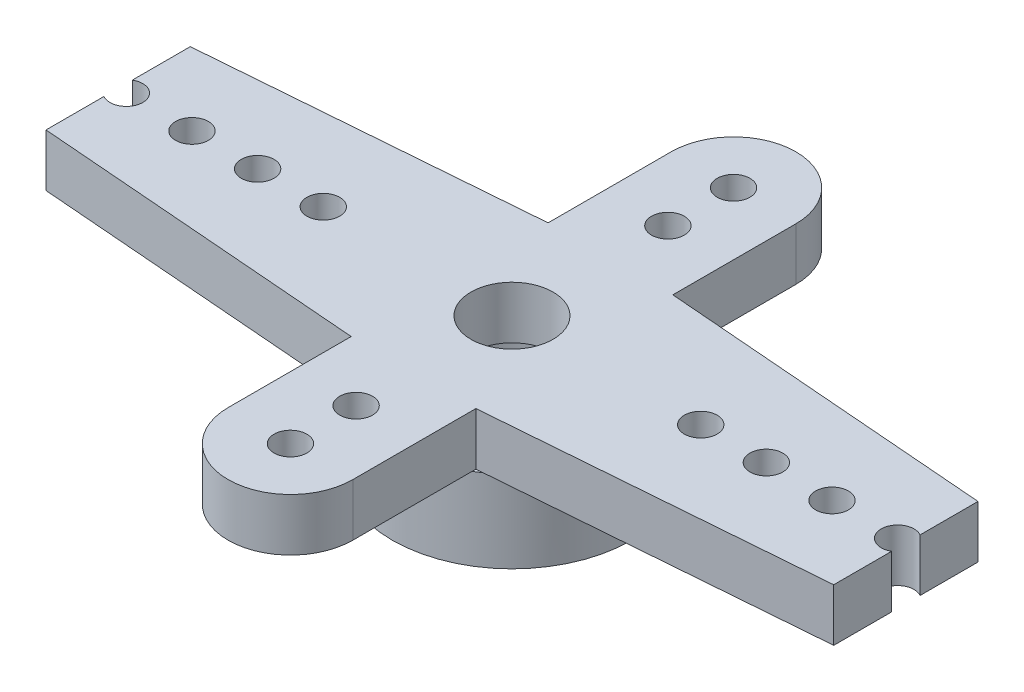
ISO-10303-21;
HEADER;
FILE_DESCRIPTION(('STEP AP214'),'2;1');
FILE_NAME('part.step','',(''),(''),'','','');
FILE_SCHEMA(('AUTOMOTIVE_DESIGN { 1 0 10303 214 1 1 1 1 }'));
ENDSEC;
DATA;
#1=APPLICATION_CONTEXT('core data for automotive mechanical design processes');
#2=APPLICATION_PROTOCOL_DEFINITION('international standard','automotive_design',2000,#1);
#3=PRODUCT_CONTEXT('',#1,'mechanical');
#4=PRODUCT('Part','Part','',(#3));
#5=PRODUCT_RELATED_PRODUCT_CATEGORY('part','',(#4));
#6=PRODUCT_DEFINITION_FORMATION('','',#4);
#7=PRODUCT_DEFINITION_CONTEXT('part definition',#1,'design');
#8=PRODUCT_DEFINITION('design','',#6,#7);
#9=PRODUCT_DEFINITION_SHAPE('','',#8);
#10=(LENGTH_UNIT() NAMED_UNIT(*) SI_UNIT(.MILLI.,.METRE.));
#11=(NAMED_UNIT(*) PLANE_ANGLE_UNIT() SI_UNIT($,.RADIAN.));
#12=(NAMED_UNIT(*) SI_UNIT($,.STERADIAN.) SOLID_ANGLE_UNIT());
#13=UNCERTAINTY_MEASURE_WITH_UNIT(LENGTH_MEASURE(1.E-05),#10,'distance_accuracy_value','');
#14=(GEOMETRIC_REPRESENTATION_CONTEXT(3) GLOBAL_UNCERTAINTY_ASSIGNED_CONTEXT((#13)) GLOBAL_UNIT_ASSIGNED_CONTEXT((#10,
#11,#12)) REPRESENTATION_CONTEXT('',''));
#15=CARTESIAN_POINT('',(0.,0.,0.));
#16=DIRECTION('',(0.,0.,1.));
#17=DIRECTION('',(1.,0.,0.));
#18=AXIS2_PLACEMENT_3D('',#15,#16,#17);
#19=CARTESIAN_POINT('',(0.,2.5,0.));
#20=DIRECTION('',(0.,1.,0.));
#21=DIRECTION('',(0.,0.,1.));
#22=AXIS2_PLACEMENT_3D('',#19,#20,#21);
#23=PLANE('',#22);
#24=DIRECTION('',(0.,0.,-1.));
#25=VECTOR('',#24,1.);
#26=CARTESIAN_POINT('',(1.9,2.5,-6.75));
#27=LINE('',#26,#25);
#28=CARTESIAN_POINT('',(1.9,2.5,-3.));
#29=VERTEX_POINT('',#28);
#30=CARTESIAN_POINT('',(1.9,2.5,-3.11648840844948));
#31=VERTEX_POINT('',#30);
#32=EDGE_CURVE('E244',#29,#31,#27,.T.);
#33=ORIENTED_EDGE('',*,*,#32,.F.);
#34=DIRECTION('',(-0.996860885732547,0.,-0.0791730667368807));
#35=VECTOR('',#34,1.);
#36=CARTESIAN_POINT('',(15.75,2.5,-1.9));
#37=LINE('',#36,#35);
#38=CARTESIAN_POINT('',(2.10202641784576,2.5,-2.9839545805321));
#39=VERTEX_POINT('',#38);
#40=EDGE_CURVE('E243',#39,#29,#37,.T.);
#41=ORIENTED_EDGE('',*,*,#40,.F.);
#42=CARTESIAN_POINT('',(0.,2.5,0.));
#43=DIRECTION('',(0.,1.,0.));
#44=DIRECTION('',(0.,0.,1.));
#45=AXIS2_PLACEMENT_3D('',#42,#43,#44);
#46=CIRCLE('',#45,3.65);
#47=EDGE_CURVE('E475',#39,#31,#46,.T.);
#48=ORIENTED_EDGE('',*,*,#47,.T.);
#49=EDGE_LOOP('',(#33,#41,#48));
#50=FACE_BOUND('',#49,.T.);
#51=ADVANCED_FACE('F36',(#50),#23,.T.);
#52=DIRECTION('',(0.996860885732547,0.,-0.0791730667368813));
#53=VECTOR('',#52,1.);
#54=CARTESIAN_POINT('',(15.75,2.5,1.9));
#55=LINE('',#54,#53);
#56=CARTESIAN_POINT('',(1.9,2.5,3.00000000000001));
#57=VERTEX_POINT('',#56);
#58=CARTESIAN_POINT('',(2.10202641784575,2.5,2.98395458053211));
#59=VERTEX_POINT('',#58);
#60=EDGE_CURVE('E237',#57,#59,#55,.T.);
#61=ORIENTED_EDGE('',*,*,#60,.F.);
#62=DIRECTION('',(0.,0.,-1.));
#63=VECTOR('',#62,1.);
#64=CARTESIAN_POINT('',(1.9,2.5,6.75000000000001));
#65=LINE('',#64,#63);
#66=CARTESIAN_POINT('',(1.9,2.5,3.11648840844948));
#67=VERTEX_POINT('',#66);
#68=EDGE_CURVE('E236',#67,#57,#65,.T.);
#69=ORIENTED_EDGE('',*,*,#68,.F.);
#70=EDGE_CURVE('E276',#67,#59,#46,.T.);
#71=ORIENTED_EDGE('',*,*,#70,.T.);
#72=EDGE_LOOP('',(#61,#69,#71));
#73=FACE_BOUND('',#72,.T.);
#74=ADVANCED_FACE('F430',(#73),#23,.T.);
#75=DIRECTION('',(0.,0.,1.));
#76=VECTOR('',#75,1.);
#77=CARTESIAN_POINT('',(-1.9,2.5,6.75000000000001));
#78=LINE('',#77,#76);
#79=CARTESIAN_POINT('',(-1.9,2.5,3.00000000000001));
#80=VERTEX_POINT('',#79);
#81=CARTESIAN_POINT('',(-1.9,2.5,3.11648840844949));
#82=VERTEX_POINT('',#81);
#83=EDGE_CURVE('E227',#80,#82,#78,.T.);
#84=ORIENTED_EDGE('',*,*,#83,.F.);
#85=DIRECTION('',(0.996860885732547,0.,0.0791730667368811));
#86=VECTOR('',#85,1.);
#87=CARTESIAN_POINT('',(-15.75,2.5,1.9));
#88=LINE('',#87,#86);
#89=CARTESIAN_POINT('',(-2.10202641784575,2.5,2.98395458053211));
#90=VERTEX_POINT('',#89);
#91=EDGE_CURVE('E226',#90,#80,#88,.T.);
#92=ORIENTED_EDGE('',*,*,#91,.F.);
#93=EDGE_CURVE('E478',#90,#82,#46,.T.);
#94=ORIENTED_EDGE('',*,*,#93,.T.);
#95=EDGE_LOOP('',(#84,#92,#94));
#96=FACE_BOUND('',#95,.T.);
#97=ADVANCED_FACE('F437',(#96),#23,.T.);
#98=DIRECTION('',(-0.996860885732547,0.,0.079173066736881));
#99=VECTOR('',#98,1.);
#100=CARTESIAN_POINT('',(-15.75,2.5,-1.9));
#101=LINE('',#100,#99);
#102=CARTESIAN_POINT('',(-1.9,2.5,-3.));
#103=VERTEX_POINT('',#102);
#104=CARTESIAN_POINT('',(-2.10202641784576,2.5,-2.9839545805321));
#105=VERTEX_POINT('',#104);
#106=EDGE_CURVE('E220',#103,#105,#101,.T.);
#107=ORIENTED_EDGE('',*,*,#106,.F.);
#108=DIRECTION('',(0.,0.,1.));
#109=VECTOR('',#108,1.);
#110=CARTESIAN_POINT('',(-1.9,2.5,-6.75));
#111=LINE('',#110,#109);
#112=CARTESIAN_POINT('',(-1.9,2.5,-3.11648840844949));
#113=VERTEX_POINT('',#112);
#114=EDGE_CURVE('E219',#113,#103,#111,.T.);
#115=ORIENTED_EDGE('',*,*,#114,.F.);
#116=EDGE_CURVE('E452',#113,#105,#46,.T.);
#117=ORIENTED_EDGE('',*,*,#116,.T.);
#118=EDGE_LOOP('',(#107,#115,#117));
#119=FACE_BOUND('',#118,.T.);
#120=ADVANCED_FACE('F433',(#119),#23,.T.);
#121=CARTESIAN_POINT('',(0.,0.,0.));
#122=DIRECTION('',(0.,1.,0.));
#123=DIRECTION('',(0.,0.,1.));
#124=AXIS2_PLACEMENT_3D('',#121,#122,#123);
#125=PLANE('',#124);
#126=CARTESIAN_POINT('',(0.,0.,0.));
#127=DIRECTION('',(0.,1.,0.));
#128=DIRECTION('',(0.,0.,1.));
#129=AXIS2_PLACEMENT_3D('',#126,#127,#128);
#130=CIRCLE('',#129,3.65);
#131=CARTESIAN_POINT('',(0.,0.,3.65));
#132=VERTEX_POINT('',#131);
#133=EDGE_CURVE('E275',#132,#132,#130,.T.);
#134=ORIENTED_EDGE('',*,*,#133,.F.);
#135=EDGE_LOOP('',(#134));
#136=FACE_BOUND('',#135,.T.);
#137=CARTESIAN_POINT('',(0.,0.,0.));
#138=DIRECTION('',(0.,1.,0.));
#139=DIRECTION('',(0.,0.,1.));
#140=AXIS2_PLACEMENT_3D('',#137,#138,#139);
#141=CIRCLE('',#140,2.5);
#142=CARTESIAN_POINT('',(0.,0.,2.5));
#143=VERTEX_POINT('',#142);
#144=EDGE_CURVE('E272',#143,#143,#141,.T.);
#145=ORIENTED_EDGE('',*,*,#144,.T.);
#146=EDGE_LOOP('',(#145));
#147=FACE_BOUND('',#146,.T.);
#148=ADVANCED_FACE('F441',(#136,#147),#125,.F.);
#149=CARTESIAN_POINT('',(0.,2.5,0.));
#150=DIRECTION('',(0.,-1.,0.));
#151=DIRECTION('',(0.,0.,-1.));
#152=AXIS2_PLACEMENT_3D('',#149,#150,#151);
#153=CYLINDRICAL_SURFACE('',#152,3.65);
#154=ORIENTED_EDGE('',*,*,#70,.F.);
#155=EDGE_CURVE('E280',#82,#67,#46,.T.);
#156=ORIENTED_EDGE('',*,*,#155,.F.);
#157=ORIENTED_EDGE('',*,*,#93,.F.);
#158=EDGE_CURVE('E476',#105,#90,#46,.T.);
#159=ORIENTED_EDGE('',*,*,#158,.F.);
#160=ORIENTED_EDGE('',*,*,#116,.F.);
#161=EDGE_CURVE('E471',#31,#113,#46,.T.);
#162=ORIENTED_EDGE('',*,*,#161,.F.);
#163=ORIENTED_EDGE('',*,*,#47,.F.);
#164=EDGE_CURVE('E279',#59,#39,#46,.T.);
#165=ORIENTED_EDGE('',*,*,#164,.F.);
#166=EDGE_LOOP('',(#154,#156,#157,#159,#160,#162,#163,#165));
#167=FACE_BOUND('',#166,.T.);
#168=ORIENTED_EDGE('',*,*,#133,.T.);
#169=EDGE_LOOP('',(#168));
#170=FACE_BOUND('',#169,.T.);
#171=ADVANCED_FACE('F38',(#167,#170),#153,.T.);
#172=CARTESIAN_POINT('',(0.,2.5,0.));
#173=DIRECTION('',(0.,-1.,0.));
#174=DIRECTION('',(0.,0.,-1.));
#175=AXIS2_PLACEMENT_3D('',#172,#173,#174);
#176=CYLINDRICAL_SURFACE('',#175,2.5);
#177=CARTESIAN_POINT('',(0.,2.5,0.));
#178=DIRECTION('',(0.,1.,0.));
#179=DIRECTION('',(0.,0.,1.));
#180=AXIS2_PLACEMENT_3D('',#177,#178,#179);
#181=CIRCLE('',#180,2.5);
#182=CARTESIAN_POINT('',(0.,2.5,2.5));
#183=VERTEX_POINT('',#182);
#184=EDGE_CURVE('E269',#183,#183,#181,.T.);
#185=ORIENTED_EDGE('',*,*,#184,.T.);
#186=EDGE_LOOP('',(#185));
#187=FACE_BOUND('',#186,.T.);
#188=ORIENTED_EDGE('',*,*,#144,.F.);
#189=EDGE_LOOP('',(#188));
#190=FACE_BOUND('',#189,.T.);
#191=ADVANCED_FACE('F576',(#187,#190),#176,.F.);
#192=CARTESIAN_POINT('',(0.,2.5,-6.75));
#193=DIRECTION('',(0.,-1.,0.));
#194=DIRECTION('',(0.,0.,-1.));
#195=AXIS2_PLACEMENT_3D('',#192,#193,#194);
#196=PLANE('',#195);
#197=DIRECTION('',(0.,0.,-1.));
#198=VECTOR('',#197,1.);
#199=CARTESIAN_POINT('',(12.,2.5,-6.75000000000008));
#200=LINE('',#199,#198);
#201=CARTESIAN_POINT('',(12.,2.5,2.19783393501805));
#202=VERTEX_POINT('',#201);
#203=CARTESIAN_POINT('',(12.,2.5,0.433012701892139));
#204=VERTEX_POINT('',#203);
#205=EDGE_CURVE('E181',#202,#204,#200,.T.);
#206=ORIENTED_EDGE('',*,*,#205,.F.);
#207=EDGE_CURVE('E235',#59,#202,#55,.T.);
#208=ORIENTED_EDGE('',*,*,#207,.F.);
#209=ORIENTED_EDGE('',*,*,#164,.T.);
#210=CARTESIAN_POINT('',(12.,2.5,-2.19783393501805));
#211=VERTEX_POINT('',#210);
#212=EDGE_CURVE('E240',#211,#39,#37,.T.);
#213=ORIENTED_EDGE('',*,*,#212,.F.);
#214=CARTESIAN_POINT('',(12.,2.5,-0.433012701892303));
#215=VERTEX_POINT('',#214);
#216=EDGE_CURVE('E177',#215,#211,#200,.T.);
#217=ORIENTED_EDGE('',*,*,#216,.F.);
#218=CARTESIAN_POINT('',(11.75,2.5,0.));
#219=DIRECTION('',(0.,-1.,0.));
#220=DIRECTION('',(0.,0.,-1.));
#221=AXIS2_PLACEMENT_3D('',#218,#219,#220);
#222=CIRCLE('',#221,0.500000000000003);
#223=EDGE_CURVE('E364',#215,#204,#222,.F.);
#224=ORIENTED_EDGE('',*,*,#223,.T.);
#225=EDGE_LOOP('',(#206,#208,#209,#213,#217,#224));
#226=FACE_BOUND('',#225,.T.);
#227=CARTESIAN_POINT('',(7.75,2.5,0.));
#228=DIRECTION('',(0.,-1.,0.));
#229=DIRECTION('',(0.,0.,-1.));
#230=AXIS2_PLACEMENT_3D('',#227,#228,#229);
#231=CIRCLE('',#230,0.5);
#232=CARTESIAN_POINT('',(7.75,2.5,-0.500000000000052));
#233=VERTEX_POINT('',#232);
#234=EDGE_CURVE('E376',#233,#233,#231,.F.);
#235=ORIENTED_EDGE('',*,*,#234,.T.);
#236=EDGE_LOOP('',(#235));
#237=FACE_BOUND('',#236,.T.);
#238=CARTESIAN_POINT('',(9.75,2.5,0.));
#239=DIRECTION('',(0.,-1.,0.));
#240=DIRECTION('',(0.,0.,-1.));
#241=AXIS2_PLACEMENT_3D('',#238,#239,#240);
#242=CIRCLE('',#241,0.500000000000003);
#243=CARTESIAN_POINT('',(9.75,2.5,-0.500000000000069));
#244=VERTEX_POINT('',#243);
#245=EDGE_CURVE('E382',#244,#244,#242,.F.);
#246=ORIENTED_EDGE('',*,*,#245,.T.);
#247=EDGE_LOOP('',(#246));
#248=FACE_BOUND('',#247,.T.);
#249=CARTESIAN_POINT('',(5.75,2.5,0.));
#250=DIRECTION('',(0.,-1.,0.));
#251=DIRECTION('',(0.,0.,-1.));
#252=AXIS2_PLACEMENT_3D('',#249,#250,#251);
#253=CIRCLE('',#252,0.5);
#254=CARTESIAN_POINT('',(5.75,2.5,-0.500000000000038));
#255=VERTEX_POINT('',#254);
#256=EDGE_CURVE('E306',#255,#255,#253,.F.);
#257=ORIENTED_EDGE('',*,*,#256,.T.);
#258=EDGE_LOOP('',(#257));
#259=FACE_BOUND('',#258,.T.);
#260=ADVANCED_FACE('F411',(#226,#237,#248,#259),#196,.T.);
#261=CARTESIAN_POINT('',(0.,2.5,-6.75));
#262=DIRECTION('',(0.,-1.,0.));
#263=DIRECTION('',(0.,0.,-1.));
#264=AXIS2_PLACEMENT_3D('',#261,#262,#263);
#265=CIRCLE('',#264,0.5);
#266=CARTESIAN_POINT('',(0.,2.5,-7.25));
#267=VERTEX_POINT('',#266);
#268=EDGE_CURVE('E310',#267,#267,#265,.F.);
#269=ORIENTED_EDGE('',*,*,#268,.T.);
#270=EDGE_LOOP('',(#269));
#271=FACE_BOUND('',#270,.T.);
#272=CARTESIAN_POINT('',(0.,2.5,-4.75));
#273=DIRECTION('',(0.,-1.,0.));
#274=DIRECTION('',(0.,0.,-1.));
#275=AXIS2_PLACEMENT_3D('',#272,#273,#274);
#276=CIRCLE('',#275,0.5);
#277=CARTESIAN_POINT('',(0.,2.5,-5.25));
#278=VERTEX_POINT('',#277);
#279=EDGE_CURVE('E298',#278,#278,#276,.F.);
#280=ORIENTED_EDGE('',*,*,#279,.T.);
#281=EDGE_LOOP('',(#280));
#282=FACE_BOUND('',#281,.T.);
#283=CARTESIAN_POINT('',(1.9,2.5,-6.75));
#284=VERTEX_POINT('',#283);
#285=EDGE_CURVE('E242',#31,#284,#27,.T.);
#286=ORIENTED_EDGE('',*,*,#285,.F.);
#287=ORIENTED_EDGE('',*,*,#161,.T.);
#288=CARTESIAN_POINT('',(-1.9,2.5,-6.75));
#289=VERTEX_POINT('',#288);
#290=EDGE_CURVE('E214',#289,#113,#111,.T.);
#291=ORIENTED_EDGE('',*,*,#290,.F.);
#292=CARTESIAN_POINT('',(0.,2.5,-6.75));
#293=DIRECTION('',(0.,1.,0.));
#294=DIRECTION('',(0.,0.,-1.));
#295=AXIS2_PLACEMENT_3D('',#292,#293,#294);
#296=CIRCLE('',#295,1.9);
#297=EDGE_CURVE('E211',#284,#289,#296,.T.);
#298=ORIENTED_EDGE('',*,*,#297,.F.);
#299=EDGE_LOOP('',(#286,#287,#291,#298));
#300=FACE_BOUND('',#299,.T.);
#301=ADVANCED_FACE('F469',(#271,#282,#300),#196,.T.);
#302=DIRECTION('',(0.,0.,1.));
#303=VECTOR('',#302,1.);
#304=CARTESIAN_POINT('',(-12.,2.5,-6.75));
#305=LINE('',#304,#303);
#306=CARTESIAN_POINT('',(-12.,2.5,-2.19783393501805));
#307=VERTEX_POINT('',#306);
#308=CARTESIAN_POINT('',(-12.,2.5,-0.433012701892216));
#309=VERTEX_POINT('',#308);
#310=EDGE_CURVE('E59',#307,#309,#305,.T.);
#311=ORIENTED_EDGE('',*,*,#310,.F.);
#312=EDGE_CURVE('E218',#105,#307,#101,.T.);
#313=ORIENTED_EDGE('',*,*,#312,.F.);
#314=ORIENTED_EDGE('',*,*,#158,.T.);
#315=CARTESIAN_POINT('',(-12.,2.5,2.19783393501805));
#316=VERTEX_POINT('',#315);
#317=EDGE_CURVE('E223',#316,#90,#88,.T.);
#318=ORIENTED_EDGE('',*,*,#317,.F.);
#319=CARTESIAN_POINT('',(-12.,2.5,0.433012701892222));
#320=VERTEX_POINT('',#319);
#321=EDGE_CURVE('E345',#320,#316,#305,.T.);
#322=ORIENTED_EDGE('',*,*,#321,.F.);
#323=CARTESIAN_POINT('',(-11.75,2.5,0.));
#324=DIRECTION('',(0.,-1.,0.));
#325=DIRECTION('',(0.,0.,-1.));
#326=AXIS2_PLACEMENT_3D('',#323,#324,#325);
#327=CIRCLE('',#326,0.500000000000001);
#328=EDGE_CURVE('E294',#320,#309,#327,.F.);
#329=ORIENTED_EDGE('',*,*,#328,.T.);
#330=EDGE_LOOP('',(#311,#313,#314,#318,#322,#329));
#331=FACE_BOUND('',#330,.T.);
#332=CARTESIAN_POINT('',(-9.75,2.5,0.));
#333=DIRECTION('',(0.,-1.,0.));
#334=DIRECTION('',(0.,0.,-1.));
#335=AXIS2_PLACEMENT_3D('',#332,#333,#334);
#336=CIRCLE('',#335,0.500000000000001);
#337=CARTESIAN_POINT('',(-9.75,2.5,-0.499999999999998));
#338=VERTEX_POINT('',#337);
#339=EDGE_CURVE('E390',#338,#338,#336,.F.);
#340=ORIENTED_EDGE('',*,*,#339,.T.);
#341=EDGE_LOOP('',(#340));
#342=FACE_BOUND('',#341,.T.);
#343=CARTESIAN_POINT('',(-7.75,2.5,0.));
#344=DIRECTION('',(0.,-1.,0.));
#345=DIRECTION('',(0.,0.,-1.));
#346=AXIS2_PLACEMENT_3D('',#343,#344,#345);
#347=CIRCLE('',#346,0.500000000000001);
#348=CARTESIAN_POINT('',(-7.75,2.5,-0.499999999999998));
#349=VERTEX_POINT('',#348);
#350=EDGE_CURVE('E396',#349,#349,#347,.F.);
#351=ORIENTED_EDGE('',*,*,#350,.T.);
#352=EDGE_LOOP('',(#351));
#353=FACE_BOUND('',#352,.T.);
#354=CARTESIAN_POINT('',(-5.75,2.5,0.));
#355=DIRECTION('',(0.,-1.,0.));
#356=DIRECTION('',(0.,0.,-1.));
#357=AXIS2_PLACEMENT_3D('',#354,#355,#356);
#358=CIRCLE('',#357,0.500000000000001);
#359=CARTESIAN_POINT('',(-5.75,2.5,-0.499999999999998));
#360=VERTEX_POINT('',#359);
#361=EDGE_CURVE('E402',#360,#360,#358,.F.);
#362=ORIENTED_EDGE('',*,*,#361,.T.);
#363=EDGE_LOOP('',(#362));
#364=FACE_BOUND('',#363,.T.);
#365=ADVANCED_FACE('F514',(#331,#342,#353,#364),#196,.T.);
#366=CARTESIAN_POINT('',(0.,2.5,0.));
#367=DIRECTION('',(0.,1.,0.));
#368=DIRECTION('',(0.,0.,1.));
#369=AXIS2_PLACEMENT_3D('',#366,#367,#368);
#370=CIRCLE('',#369,1.25);
#371=CARTESIAN_POINT('',(0.,2.5,1.25));
#372=VERTEX_POINT('',#371);
#373=EDGE_CURVE('E314',#372,#372,#370,.T.);
#374=ORIENTED_EDGE('',*,*,#373,.T.);
#375=EDGE_LOOP('',(#374));
#376=FACE_BOUND('',#375,.T.);
#377=ORIENTED_EDGE('',*,*,#184,.F.);
#378=EDGE_LOOP('',(#377));
#379=FACE_BOUND('',#378,.T.);
#380=ADVANCED_FACE('F558',(#376,#379),#196,.T.);
#381=CARTESIAN_POINT('',(0.,4.1,-6.75));
#382=DIRECTION('',(0.,-1.,0.));
#383=DIRECTION('',(0.,0.,-1.));
#384=AXIS2_PLACEMENT_3D('',#381,#382,#383);
#385=PLANE('',#384);
#386=CARTESIAN_POINT('',(0.,4.1,-6.75));
#387=DIRECTION('',(0.,1.,0.));
#388=DIRECTION('',(0.,0.,1.));
#389=AXIS2_PLACEMENT_3D('',#386,#387,#388);
#390=CIRCLE('',#389,0.5);
#391=CARTESIAN_POINT('',(0.,4.1,-6.25));
#392=VERTEX_POINT('',#391);
#393=EDGE_CURVE('E317',#392,#392,#390,.T.);
#394=ORIENTED_EDGE('',*,*,#393,.F.);
#395=EDGE_LOOP('',(#394));
#396=FACE_BOUND('',#395,.T.);
#397=CARTESIAN_POINT('',(7.75,4.1,0.));
#398=DIRECTION('',(0.,1.,0.));
#399=DIRECTION('',(0.,0.,-1.));
#400=AXIS2_PLACEMENT_3D('',#397,#398,#399);
#401=CIRCLE('',#400,0.5);
#402=CARTESIAN_POINT('',(7.75,4.1,-0.500000000000052));
#403=VERTEX_POINT('',#402);
#404=EDGE_CURVE('E373',#403,#403,#401,.T.);
#405=ORIENTED_EDGE('',*,*,#404,.F.);
#406=EDGE_LOOP('',(#405));
#407=FACE_BOUND('',#406,.T.);
#408=CARTESIAN_POINT('',(9.75,4.1,0.));
#409=DIRECTION('',(0.,1.,0.));
#410=DIRECTION('',(0.,0.,-1.));
#411=AXIS2_PLACEMENT_3D('',#408,#409,#410);
#412=CIRCLE('',#411,0.500000000000003);
#413=CARTESIAN_POINT('',(9.75,4.1,-0.500000000000069));
#414=VERTEX_POINT('',#413);
#415=EDGE_CURVE('E379',#414,#414,#412,.T.);
#416=ORIENTED_EDGE('',*,*,#415,.F.);
#417=EDGE_LOOP('',(#416));
#418=FACE_BOUND('',#417,.T.);
#419=CARTESIAN_POINT('',(0.,4.1,4.75));
#420=DIRECTION('',(0.,1.,0.));
#421=DIRECTION('',(0.,0.,-1.));
#422=AXIS2_PLACEMENT_3D('',#419,#420,#421);
#423=CIRCLE('',#422,0.5);
#424=CARTESIAN_POINT('',(0.,4.1,4.25));
#425=VERTEX_POINT('',#424);
#426=EDGE_CURVE('E361',#425,#425,#423,.T.);
#427=ORIENTED_EDGE('',*,*,#426,.F.);
#428=EDGE_LOOP('',(#427));
#429=FACE_BOUND('',#428,.T.);
#430=CARTESIAN_POINT('',(0.,4.1,6.75));
#431=DIRECTION('',(0.,1.,0.));
#432=DIRECTION('',(0.,0.,-1.));
#433=AXIS2_PLACEMENT_3D('',#430,#431,#432);
#434=CIRCLE('',#433,0.5);
#435=CARTESIAN_POINT('',(0.,4.1,6.25));
#436=VERTEX_POINT('',#435);
#437=EDGE_CURVE('E368',#436,#436,#434,.T.);
#438=ORIENTED_EDGE('',*,*,#437,.F.);
#439=EDGE_LOOP('',(#438));
#440=FACE_BOUND('',#439,.T.);
#441=DIRECTION('',(-0.996860885732547,0.,0.079173066736881));
#442=VECTOR('',#441,1.);
#443=CARTESIAN_POINT('',(-15.75,4.1,-1.9));
#444=LINE('',#443,#442);
#445=CARTESIAN_POINT('',(-1.9,4.1,-3.));
#446=VERTEX_POINT('',#445);
#447=CARTESIAN_POINT('',(-12.,4.1,-2.19783393501805));
#448=VERTEX_POINT('',#447);
#449=EDGE_CURVE('E322',#446,#448,#444,.T.);
#450=ORIENTED_EDGE('',*,*,#449,.T.);
#451=DIRECTION('',(0.,0.,-1.));
#452=VECTOR('',#451,1.);
#453=CARTESIAN_POINT('',(-12.,4.1,-6.92336076349166));
#454=LINE('',#453,#452);
#455=CARTESIAN_POINT('',(-12.,4.1,-0.433012701892215));
#456=VERTEX_POINT('',#455);
#457=EDGE_CURVE('E193',#456,#448,#454,.T.);
#458=ORIENTED_EDGE('',*,*,#457,.F.);
#459=CARTESIAN_POINT('',(-11.75,4.1,0.));
#460=DIRECTION('',(0.,1.,0.));
#461=DIRECTION('',(0.,0.,1.));
#462=AXIS2_PLACEMENT_3D('',#459,#460,#461);
#463=CIRCLE('',#462,0.500000000000001);
#464=CARTESIAN_POINT('',(-12.,4.1,0.433012701892222));
#465=VERTEX_POINT('',#464);
#466=EDGE_CURVE('E292',#465,#456,#463,.T.);
#467=ORIENTED_EDGE('',*,*,#466,.F.);
#468=CARTESIAN_POINT('',(-12.,4.1,2.19783393501805));
#469=VERTEX_POINT('',#468);
#470=EDGE_CURVE('E51',#469,#465,#454,.T.);
#471=ORIENTED_EDGE('',*,*,#470,.F.);
#472=DIRECTION('',(0.996860885732547,0.,0.0791730667368811));
#473=VECTOR('',#472,1.);
#474=CARTESIAN_POINT('',(-15.75,4.1,1.9));
#475=LINE('',#474,#473);
#476=CARTESIAN_POINT('',(-1.9,4.1,3.00000000000001));
#477=VERTEX_POINT('',#476);
#478=EDGE_CURVE('E324',#469,#477,#475,.T.);
#479=ORIENTED_EDGE('',*,*,#478,.T.);
#480=DIRECTION('',(0.,0.,1.));
#481=VECTOR('',#480,1.);
#482=CARTESIAN_POINT('',(-1.9,4.1,6.75000000000001));
#483=LINE('',#482,#481);
#484=CARTESIAN_POINT('',(-1.9,4.1,6.75000000000001));
#485=VERTEX_POINT('',#484);
#486=EDGE_CURVE('E326',#477,#485,#483,.T.);
#487=ORIENTED_EDGE('',*,*,#486,.T.);
#488=CARTESIAN_POINT('',(0.,4.1,6.75));
#489=DIRECTION('',(0.,1.,0.));
#490=DIRECTION('',(0.,0.,1.));
#491=AXIS2_PLACEMENT_3D('',#488,#489,#490);
#492=CIRCLE('',#491,1.9);
#493=CARTESIAN_POINT('',(1.9,4.1,6.75000000000001));
#494=VERTEX_POINT('',#493);
#495=EDGE_CURVE('E328',#485,#494,#492,.T.);
#496=ORIENTED_EDGE('',*,*,#495,.T.);
#497=DIRECTION('',(0.,0.,-1.));
#498=VECTOR('',#497,1.);
#499=CARTESIAN_POINT('',(1.9,4.1,6.75000000000001));
#500=LINE('',#499,#498);
#501=CARTESIAN_POINT('',(1.9,4.1,3.00000000000001));
#502=VERTEX_POINT('',#501);
#503=EDGE_CURVE('E207',#494,#502,#500,.T.);
#504=ORIENTED_EDGE('',*,*,#503,.T.);
#505=DIRECTION('',(0.996860885732547,0.,-0.0791730667368813));
#506=VECTOR('',#505,1.);
#507=CARTESIAN_POINT('',(15.75,4.1,1.9));
#508=LINE('',#507,#506);
#509=CARTESIAN_POINT('',(12.,4.1,2.19783393501805));
#510=VERTEX_POINT('',#509);
#511=EDGE_CURVE('E202',#502,#510,#508,.T.);
#512=ORIENTED_EDGE('',*,*,#511,.T.);
#513=DIRECTION('',(0.,0.,1.));
#514=VECTOR('',#513,1.);
#515=CARTESIAN_POINT('',(12.,4.1,-6.92336076349166));
#516=LINE('',#515,#514);
#517=CARTESIAN_POINT('',(12.,4.1,0.433012701892139));
#518=VERTEX_POINT('',#517);
#519=EDGE_CURVE('E194',#518,#510,#516,.T.);
#520=ORIENTED_EDGE('',*,*,#519,.F.);
#521=CARTESIAN_POINT('',(11.75,4.1,0.));
#522=DIRECTION('',(0.,1.,0.));
#523=DIRECTION('',(0.,0.,-1.));
#524=AXIS2_PLACEMENT_3D('',#521,#522,#523);
#525=CIRCLE('',#524,0.500000000000003);
#526=CARTESIAN_POINT('',(12.,4.1,-0.433012701892303));
#527=VERTEX_POINT('',#526);
#528=EDGE_CURVE('E192',#527,#518,#525,.T.);
#529=ORIENTED_EDGE('',*,*,#528,.F.);
#530=CARTESIAN_POINT('',(12.,4.1,-2.19783393501805));
#531=VERTEX_POINT('',#530);
#532=EDGE_CURVE('E174',#531,#527,#516,.T.);
#533=ORIENTED_EDGE('',*,*,#532,.F.);
#534=DIRECTION('',(-0.996860885732547,0.,-0.0791730667368807));
#535=VECTOR('',#534,1.);
#536=CARTESIAN_POINT('',(15.75,4.1,-1.9));
#537=LINE('',#536,#535);
#538=CARTESIAN_POINT('',(1.9,4.1,-3.));
#539=VERTEX_POINT('',#538);
#540=EDGE_CURVE('E188',#531,#539,#537,.T.);
#541=ORIENTED_EDGE('',*,*,#540,.T.);
#542=DIRECTION('',(0.,0.,-1.));
#543=VECTOR('',#542,1.);
#544=CARTESIAN_POINT('',(1.9,4.1,-6.75));
#545=LINE('',#544,#543);
#546=CARTESIAN_POINT('',(1.9,4.1,-6.75));
#547=VERTEX_POINT('',#546);
#548=EDGE_CURVE('E201',#539,#547,#545,.T.);
#549=ORIENTED_EDGE('',*,*,#548,.T.);
#550=CARTESIAN_POINT('',(0.,4.1,-6.75));
#551=DIRECTION('',(0.,1.,0.));
#552=DIRECTION('',(0.,0.,-1.));
#553=AXIS2_PLACEMENT_3D('',#550,#551,#552);
#554=CIRCLE('',#553,1.9);
#555=CARTESIAN_POINT('',(-1.9,4.1,-6.75));
#556=VERTEX_POINT('',#555);
#557=EDGE_CURVE('E247',#547,#556,#554,.T.);
#558=ORIENTED_EDGE('',*,*,#557,.T.);
#559=DIRECTION('',(0.,0.,1.));
#560=VECTOR('',#559,1.);
#561=CARTESIAN_POINT('',(-1.9,4.1,-6.75));
#562=LINE('',#561,#560);
#563=EDGE_CURVE('E320',#556,#446,#562,.T.);
#564=ORIENTED_EDGE('',*,*,#563,.T.);
#565=EDGE_LOOP('',(#450,#458,#467,#471,#479,#487,#496,#504,#512,#520,#529,#533,#541,#549,#558,#564));
#566=FACE_BOUND('',#565,.T.);
#567=CARTESIAN_POINT('',(0.,4.1,-4.75));
#568=DIRECTION('',(0.,1.,0.));
#569=DIRECTION('',(0.,0.,1.));
#570=AXIS2_PLACEMENT_3D('',#567,#568,#569);
#571=CIRCLE('',#570,0.5);
#572=CARTESIAN_POINT('',(0.,4.1,-4.25));
#573=VERTEX_POINT('',#572);
#574=EDGE_CURVE('E301',#573,#573,#571,.T.);
#575=ORIENTED_EDGE('',*,*,#574,.F.);
#576=EDGE_LOOP('',(#575));
#577=FACE_BOUND('',#576,.T.);
#578=CARTESIAN_POINT('',(-9.75,4.1,0.));
#579=DIRECTION('',(0.,1.,0.));
#580=DIRECTION('',(0.,0.,1.));
#581=AXIS2_PLACEMENT_3D('',#578,#579,#580);
#582=CIRCLE('',#581,0.500000000000001);
#583=CARTESIAN_POINT('',(-9.75,4.1,0.500000000000004));
#584=VERTEX_POINT('',#583);
#585=EDGE_CURVE('E303',#584,#584,#582,.T.);
#586=ORIENTED_EDGE('',*,*,#585,.F.);
#587=EDGE_LOOP('',(#586));
#588=FACE_BOUND('',#587,.T.);
#589=CARTESIAN_POINT('',(-7.75,4.1,0.));
#590=DIRECTION('',(0.,1.,0.));
#591=DIRECTION('',(0.,0.,1.));
#592=AXIS2_PLACEMENT_3D('',#589,#590,#591);
#593=CIRCLE('',#592,0.500000000000001);
#594=CARTESIAN_POINT('',(-7.75,4.1,0.500000000000004));
#595=VERTEX_POINT('',#594);
#596=EDGE_CURVE('E393',#595,#595,#593,.T.);
#597=ORIENTED_EDGE('',*,*,#596,.F.);
#598=EDGE_LOOP('',(#597));
#599=FACE_BOUND('',#598,.T.);
#600=CARTESIAN_POINT('',(-5.75,4.1,0.));
#601=DIRECTION('',(0.,1.,0.));
#602=DIRECTION('',(0.,0.,1.));
#603=AXIS2_PLACEMENT_3D('',#600,#601,#602);
#604=CIRCLE('',#603,0.500000000000001);
#605=CARTESIAN_POINT('',(-5.75,4.1,0.500000000000004));
#606=VERTEX_POINT('',#605);
#607=EDGE_CURVE('E399',#606,#606,#604,.T.);
#608=ORIENTED_EDGE('',*,*,#607,.F.);
#609=EDGE_LOOP('',(#608));
#610=FACE_BOUND('',#609,.T.);
#611=CARTESIAN_POINT('',(5.75,4.1,0.));
#612=DIRECTION('',(0.,1.,0.));
#613=DIRECTION('',(0.,0.,-1.));
#614=AXIS2_PLACEMENT_3D('',#611,#612,#613);
#615=CIRCLE('',#614,0.5);
#616=CARTESIAN_POINT('',(5.75,4.1,-0.500000000000038));
#617=VERTEX_POINT('',#616);
#618=EDGE_CURVE('E404',#617,#617,#615,.T.);
#619=ORIENTED_EDGE('',*,*,#618,.F.);
#620=EDGE_LOOP('',(#619));
#621=FACE_BOUND('',#620,.T.);
#622=CARTESIAN_POINT('',(0.,4.1,0.));
#623=DIRECTION('',(0.,1.,0.));
#624=DIRECTION('',(0.,0.,1.));
#625=AXIS2_PLACEMENT_3D('',#622,#623,#624);
#626=CIRCLE('',#625,1.25);
#627=CARTESIAN_POINT('',(0.,4.1,1.25));
#628=VERTEX_POINT('',#627);
#629=EDGE_CURVE('E215',#628,#628,#626,.T.);
#630=ORIENTED_EDGE('',*,*,#629,.F.);
#631=EDGE_LOOP('',(#630));
#632=FACE_BOUND('',#631,.T.);
#633=ADVANCED_FACE('F186',(#396,#407,#418,#429,#440,#566,#577,#588,#599,#610,#621,#632),#385,.F.);
#634=CARTESIAN_POINT('',(0.,2.5,4.75));
#635=DIRECTION('',(0.,-1.,0.));
#636=DIRECTION('',(0.,0.,-1.));
#637=AXIS2_PLACEMENT_3D('',#634,#635,#636);
#638=CIRCLE('',#637,0.5);
#639=CARTESIAN_POINT('',(0.,2.5,4.25));
#640=VERTEX_POINT('',#639);
#641=EDGE_CURVE('E365',#640,#640,#638,.F.);
#642=ORIENTED_EDGE('',*,*,#641,.T.);
#643=EDGE_LOOP('',(#642));
#644=FACE_BOUND('',#643,.T.);
#645=CARTESIAN_POINT('',(0.,2.5,6.75));
#646=DIRECTION('',(0.,-1.,0.));
#647=DIRECTION('',(0.,0.,-1.));
#648=AXIS2_PLACEMENT_3D('',#645,#646,#647);
#649=CIRCLE('',#648,0.5);
#650=CARTESIAN_POINT('',(0.,2.5,6.25));
#651=VERTEX_POINT('',#650);
#652=EDGE_CURVE('E356',#651,#651,#649,.F.);
#653=ORIENTED_EDGE('',*,*,#652,.T.);
#654=EDGE_LOOP('',(#653));
#655=FACE_BOUND('',#654,.T.);
#656=CARTESIAN_POINT('',(-1.9,2.5,6.75000000000001));
#657=VERTEX_POINT('',#656);
#658=EDGE_CURVE('E225',#82,#657,#78,.T.);
#659=ORIENTED_EDGE('',*,*,#658,.F.);
#660=ORIENTED_EDGE('',*,*,#155,.T.);
#661=CARTESIAN_POINT('',(1.9,2.5,6.75000000000001));
#662=VERTEX_POINT('',#661);
#663=EDGE_CURVE('E232',#662,#67,#65,.T.);
#664=ORIENTED_EDGE('',*,*,#663,.F.);
#665=CARTESIAN_POINT('',(0.,2.5,6.75));
#666=DIRECTION('',(0.,1.,0.));
#667=DIRECTION('',(0.,0.,1.));
#668=AXIS2_PLACEMENT_3D('',#665,#666,#667);
#669=CIRCLE('',#668,1.9);
#670=EDGE_CURVE('E230',#657,#662,#669,.T.);
#671=ORIENTED_EDGE('',*,*,#670,.F.);
#672=EDGE_LOOP('',(#659,#660,#664,#671));
#673=FACE_BOUND('',#672,.T.);
#674=ADVANCED_FACE('F488',(#644,#655,#673),#196,.T.);
#675=CARTESIAN_POINT('',(0.,4.1,-6.75));
#676=DIRECTION('',(0.,-1.,0.));
#677=DIRECTION('',(0.,0.,-1.));
#678=AXIS2_PLACEMENT_3D('',#675,#676,#677);
#679=CYLINDRICAL_SURFACE('',#678,1.9);
#680=ORIENTED_EDGE('',*,*,#297,.T.);
#681=DIRECTION('',(0.,-1.,0.));
#682=VECTOR('',#681,1.);
#683=CARTESIAN_POINT('',(-1.9,4.1,-6.75));
#684=LINE('',#683,#682);
#685=EDGE_CURVE('E266',#556,#289,#684,.T.);
#686=ORIENTED_EDGE('',*,*,#685,.F.);
#687=ORIENTED_EDGE('',*,*,#557,.F.);
#688=DIRECTION('',(0.,-1.,0.));
#689=VECTOR('',#688,1.);
#690=CARTESIAN_POINT('',(1.9,4.1,-6.75));
#691=LINE('',#690,#689);
#692=EDGE_CURVE('E204',#547,#284,#691,.T.);
#693=ORIENTED_EDGE('',*,*,#692,.T.);
#694=EDGE_LOOP('',(#680,#686,#687,#693));
#695=FACE_BOUND('',#694,.T.);
#696=ADVANCED_FACE('F465',(#695),#679,.T.);
#697=CARTESIAN_POINT('',(-1.9,4.1,-6.75));
#698=DIRECTION('',(1.,0.,0.));
#699=DIRECTION('',(0.,0.,-1.));
#700=AXIS2_PLACEMENT_3D('',#697,#698,#699);
#701=PLANE('',#700);
#702=ORIENTED_EDGE('',*,*,#290,.T.);
#703=ORIENTED_EDGE('',*,*,#114,.T.);
#704=DIRECTION('',(0.,-1.,0.));
#705=VECTOR('',#704,1.);
#706=CARTESIAN_POINT('',(-1.9,4.1,-3.));
#707=LINE('',#706,#705);
#708=EDGE_CURVE('E263',#446,#103,#707,.T.);
#709=ORIENTED_EDGE('',*,*,#708,.F.);
#710=ORIENTED_EDGE('',*,*,#563,.F.);
#711=ORIENTED_EDGE('',*,*,#685,.T.);
#712=EDGE_LOOP('',(#702,#703,#709,#710,#711));
#713=FACE_BOUND('',#712,.T.);
#714=ADVANCED_FACE('F458',(#713),#701,.F.);
#715=CARTESIAN_POINT('',(-15.75,4.1,-1.9));
#716=DIRECTION('',(0.079173066736881,0.,0.996860885732547));
#717=DIRECTION('',(0.996860885732547,0.,-0.079173066736881));
#718=AXIS2_PLACEMENT_3D('',#715,#716,#717);
#719=PLANE('',#718);
#720=ORIENTED_EDGE('',*,*,#312,.T.);
#721=DIRECTION('',(0.,1.,0.));
#722=VECTOR('',#721,1.);
#723=CARTESIAN_POINT('',(-12.,4.1,-2.19783393501805));
#724=LINE('',#723,#722);
#725=EDGE_CURVE('E353',#307,#448,#724,.T.);
#726=ORIENTED_EDGE('',*,*,#725,.T.);
#727=ORIENTED_EDGE('',*,*,#449,.F.);
#728=ORIENTED_EDGE('',*,*,#708,.T.);
#729=ORIENTED_EDGE('',*,*,#106,.T.);
#730=EDGE_LOOP('',(#720,#726,#727,#728,#729));
#731=FACE_BOUND('',#730,.T.);
#732=ADVANCED_FACE('F460',(#731),#719,.F.);
#733=CARTESIAN_POINT('',(-15.75,4.1,1.9));
#734=DIRECTION('',(0.0791730667368811,0.,-0.996860885732547));
#735=DIRECTION('',(-0.996860885732547,0.,-0.0791730667368811));
#736=AXIS2_PLACEMENT_3D('',#733,#734,#735);
#737=PLANE('',#736);
#738=ORIENTED_EDGE('',*,*,#478,.F.);
#739=DIRECTION('',(0.,-1.,0.));
#740=VECTOR('',#739,1.);
#741=CARTESIAN_POINT('',(-12.,4.1,2.19783393501805));
#742=LINE('',#741,#740);
#743=EDGE_CURVE('E347',#469,#316,#742,.T.);
#744=ORIENTED_EDGE('',*,*,#743,.T.);
#745=ORIENTED_EDGE('',*,*,#317,.T.);
#746=ORIENTED_EDGE('',*,*,#91,.T.);
#747=DIRECTION('',(0.,-1.,0.));
#748=VECTOR('',#747,1.);
#749=CARTESIAN_POINT('',(-1.9,4.1,3.00000000000001));
#750=LINE('',#749,#748);
#751=EDGE_CURVE('E260',#477,#80,#750,.T.);
#752=ORIENTED_EDGE('',*,*,#751,.F.);
#753=EDGE_LOOP('',(#738,#744,#745,#746,#752));
#754=FACE_BOUND('',#753,.T.);
#755=ADVANCED_FACE('F500',(#754),#737,.F.);
#756=CARTESIAN_POINT('',(-1.9,4.1,6.75000000000001));
#757=DIRECTION('',(1.,0.,0.));
#758=DIRECTION('',(0.,0.,-1.));
#759=AXIS2_PLACEMENT_3D('',#756,#757,#758);
#760=PLANE('',#759);
#761=ORIENTED_EDGE('',*,*,#83,.T.);
#762=ORIENTED_EDGE('',*,*,#658,.T.);
#763=DIRECTION('',(0.,-1.,0.));
#764=VECTOR('',#763,1.);
#765=CARTESIAN_POINT('',(-1.9,4.1,6.75000000000001));
#766=LINE('',#765,#764);
#767=EDGE_CURVE('E257',#485,#657,#766,.T.);
#768=ORIENTED_EDGE('',*,*,#767,.F.);
#769=ORIENTED_EDGE('',*,*,#486,.F.);
#770=ORIENTED_EDGE('',*,*,#751,.T.);
#771=EDGE_LOOP('',(#761,#762,#768,#769,#770));
#772=FACE_BOUND('',#771,.T.);
#773=ADVANCED_FACE('F496',(#772),#760,.F.);
#774=CARTESIAN_POINT('',(0.,4.1,6.75));
#775=DIRECTION('',(0.,-1.,0.));
#776=DIRECTION('',(0.,0.,-1.));
#777=AXIS2_PLACEMENT_3D('',#774,#775,#776);
#778=CYLINDRICAL_SURFACE('',#777,1.9);
#779=ORIENTED_EDGE('',*,*,#670,.T.);
#780=DIRECTION('',(0.,-1.,0.));
#781=VECTOR('',#780,1.);
#782=CARTESIAN_POINT('',(1.9,4.1,6.75000000000001));
#783=LINE('',#782,#781);
#784=EDGE_CURVE('E254',#494,#662,#783,.T.);
#785=ORIENTED_EDGE('',*,*,#784,.F.);
#786=ORIENTED_EDGE('',*,*,#495,.F.);
#787=ORIENTED_EDGE('',*,*,#767,.T.);
#788=EDGE_LOOP('',(#779,#785,#786,#787));
#789=FACE_BOUND('',#788,.T.);
#790=ADVANCED_FACE('F492',(#789),#778,.T.);
#791=CARTESIAN_POINT('',(1.9,4.1,6.75000000000001));
#792=DIRECTION('',(-1.,0.,0.));
#793=DIRECTION('',(0.,0.,1.));
#794=AXIS2_PLACEMENT_3D('',#791,#792,#793);
#795=PLANE('',#794);
#796=ORIENTED_EDGE('',*,*,#663,.T.);
#797=ORIENTED_EDGE('',*,*,#68,.T.);
#798=DIRECTION('',(0.,-1.,0.));
#799=VECTOR('',#798,1.);
#800=CARTESIAN_POINT('',(1.9,4.1,3.00000000000001));
#801=LINE('',#800,#799);
#802=EDGE_CURVE('E251',#502,#57,#801,.T.);
#803=ORIENTED_EDGE('',*,*,#802,.F.);
#804=ORIENTED_EDGE('',*,*,#503,.F.);
#805=ORIENTED_EDGE('',*,*,#784,.T.);
#806=EDGE_LOOP('',(#796,#797,#803,#804,#805));
#807=FACE_BOUND('',#806,.T.);
#808=ADVANCED_FACE('F336',(#807),#795,.F.);
#809=CARTESIAN_POINT('',(15.75,4.1,1.9));
#810=DIRECTION('',(-0.0791730667368813,0.,-0.996860885732547));
#811=DIRECTION('',(-0.996860885732547,0.,0.0791730667368813));
#812=AXIS2_PLACEMENT_3D('',#809,#810,#811);
#813=PLANE('',#812);
#814=ORIENTED_EDGE('',*,*,#207,.T.);
#815=DIRECTION('',(0.,1.,0.));
#816=VECTOR('',#815,1.);
#817=CARTESIAN_POINT('',(12.,4.1,2.19783393501805));
#818=LINE('',#817,#816);
#819=EDGE_CURVE('E341',#202,#510,#818,.T.);
#820=ORIENTED_EDGE('',*,*,#819,.T.);
#821=ORIENTED_EDGE('',*,*,#511,.F.);
#822=ORIENTED_EDGE('',*,*,#802,.T.);
#823=ORIENTED_EDGE('',*,*,#60,.T.);
#824=EDGE_LOOP('',(#814,#820,#821,#822,#823));
#825=FACE_BOUND('',#824,.T.);
#826=ADVANCED_FACE('F340',(#825),#813,.F.);
#827=CARTESIAN_POINT('',(15.75,4.1,-1.9));
#828=DIRECTION('',(-0.0791730667368807,0.,0.996860885732547));
#829=DIRECTION('',(0.996860885732547,0.,0.0791730667368807));
#830=AXIS2_PLACEMENT_3D('',#827,#828,#829);
#831=PLANE('',#830);
#832=ORIENTED_EDGE('',*,*,#540,.F.);
#833=DIRECTION('',(0.,-1.,0.));
#834=VECTOR('',#833,1.);
#835=CARTESIAN_POINT('',(12.,4.1,-2.19783393501805));
#836=LINE('',#835,#834);
#837=EDGE_CURVE('E171',#531,#211,#836,.T.);
#838=ORIENTED_EDGE('',*,*,#837,.T.);
#839=ORIENTED_EDGE('',*,*,#212,.T.);
#840=ORIENTED_EDGE('',*,*,#40,.T.);
#841=DIRECTION('',(0.,-1.,0.));
#842=VECTOR('',#841,1.);
#843=CARTESIAN_POINT('',(1.9,4.1,-3.));
#844=LINE('',#843,#842);
#845=EDGE_CURVE('E199',#539,#29,#844,.T.);
#846=ORIENTED_EDGE('',*,*,#845,.F.);
#847=EDGE_LOOP('',(#832,#838,#839,#840,#846));
#848=FACE_BOUND('',#847,.T.);
#849=ADVANCED_FACE('F196',(#848),#831,.F.);
#850=CARTESIAN_POINT('',(1.9,4.1,-6.75));
#851=DIRECTION('',(-1.,0.,0.));
#852=DIRECTION('',(0.,0.,1.));
#853=AXIS2_PLACEMENT_3D('',#850,#851,#852);
#854=PLANE('',#853);
#855=ORIENTED_EDGE('',*,*,#32,.T.);
#856=ORIENTED_EDGE('',*,*,#285,.T.);
#857=ORIENTED_EDGE('',*,*,#692,.F.);
#858=ORIENTED_EDGE('',*,*,#548,.F.);
#859=ORIENTED_EDGE('',*,*,#845,.T.);
#860=EDGE_LOOP('',(#855,#856,#857,#858,#859));
#861=FACE_BOUND('',#860,.T.);
#862=ADVANCED_FACE('F503',(#861),#854,.F.);
#863=CARTESIAN_POINT('',(0.,4.1,0.));
#864=DIRECTION('',(0.,-1.,0.));
#865=DIRECTION('',(0.,0.,-1.));
#866=AXIS2_PLACEMENT_3D('',#863,#864,#865);
#867=CYLINDRICAL_SURFACE('',#866,1.25);
#868=ORIENTED_EDGE('',*,*,#629,.T.);
#869=EDGE_LOOP('',(#868));
#870=FACE_BOUND('',#869,.T.);
#871=ORIENTED_EDGE('',*,*,#373,.F.);
#872=EDGE_LOOP('',(#871));
#873=FACE_BOUND('',#872,.T.);
#874=ADVANCED_FACE('F532',(#870,#873),#867,.F.);
#875=CARTESIAN_POINT('',(0.,-0.00100000000000013,6.75));
#876=DIRECTION('',(0.,1.,0.));
#877=DIRECTION('',(0.,0.,1.));
#878=AXIS2_PLACEMENT_3D('',#875,#876,#877);
#879=CYLINDRICAL_SURFACE('',#878,0.5);
#880=ORIENTED_EDGE('',*,*,#652,.F.);
#881=EDGE_LOOP('',(#880));
#882=FACE_BOUND('',#881,.T.);
#883=ORIENTED_EDGE('',*,*,#437,.T.);
#884=EDGE_LOOP('',(#883));
#885=FACE_BOUND('',#884,.T.);
#886=ADVANCED_FACE('F425',(#882,#885),#879,.F.);
#887=CARTESIAN_POINT('',(0.,-0.00100000000000013,4.75));
#888=DIRECTION('',(0.,1.,0.));
#889=DIRECTION('',(0.,0.,1.));
#890=AXIS2_PLACEMENT_3D('',#887,#888,#889);
#891=CYLINDRICAL_SURFACE('',#890,0.5);
#892=ORIENTED_EDGE('',*,*,#641,.F.);
#893=EDGE_LOOP('',(#892));
#894=FACE_BOUND('',#893,.T.);
#895=ORIENTED_EDGE('',*,*,#426,.T.);
#896=EDGE_LOOP('',(#895));
#897=FACE_BOUND('',#896,.T.);
#898=ADVANCED_FACE('F416',(#894,#897),#891,.F.);
#899=CARTESIAN_POINT('',(5.75,-0.00100000000000013,0.));
#900=DIRECTION('',(0.,1.,0.));
#901=DIRECTION('',(0.,0.,1.));
#902=AXIS2_PLACEMENT_3D('',#899,#900,#901);
#903=CYLINDRICAL_SURFACE('',#902,0.5);
#904=ORIENTED_EDGE('',*,*,#256,.F.);
#905=EDGE_LOOP('',(#904));
#906=FACE_BOUND('',#905,.T.);
#907=ORIENTED_EDGE('',*,*,#618,.T.);
#908=EDGE_LOOP('',(#907));
#909=FACE_BOUND('',#908,.T.);
#910=ADVANCED_FACE('F413',(#906,#909),#903,.F.);
#911=CARTESIAN_POINT('',(-5.75,-0.00100000000000013,0.));
#912=DIRECTION('',(0.,1.,0.));
#913=DIRECTION('',(0.,0.,1.));
#914=AXIS2_PLACEMENT_3D('',#911,#912,#913);
#915=CYLINDRICAL_SURFACE('',#914,0.500000000000001);
#916=ORIENTED_EDGE('',*,*,#361,.F.);
#917=EDGE_LOOP('',(#916));
#918=FACE_BOUND('',#917,.T.);
#919=ORIENTED_EDGE('',*,*,#607,.T.);
#920=EDGE_LOOP('',(#919));
#921=FACE_BOUND('',#920,.T.);
#922=ADVANCED_FACE('F415',(#918,#921),#915,.F.);
#923=CARTESIAN_POINT('',(-7.75,-0.00100000000000013,0.));
#924=DIRECTION('',(0.,1.,0.));
#925=DIRECTION('',(0.,0.,1.));
#926=AXIS2_PLACEMENT_3D('',#923,#924,#925);
#927=CYLINDRICAL_SURFACE('',#926,0.500000000000001);
#928=ORIENTED_EDGE('',*,*,#350,.F.);
#929=EDGE_LOOP('',(#928));
#930=FACE_BOUND('',#929,.T.);
#931=ORIENTED_EDGE('',*,*,#596,.T.);
#932=EDGE_LOOP('',(#931));
#933=FACE_BOUND('',#932,.T.);
#934=ADVANCED_FACE('F422',(#930,#933),#927,.F.);
#935=CARTESIAN_POINT('',(-9.75,-0.00100000000000013,0.));
#936=DIRECTION('',(0.,1.,0.));
#937=DIRECTION('',(0.,0.,1.));
#938=AXIS2_PLACEMENT_3D('',#935,#936,#937);
#939=CYLINDRICAL_SURFACE('',#938,0.500000000000001);
#940=ORIENTED_EDGE('',*,*,#339,.F.);
#941=EDGE_LOOP('',(#940));
#942=FACE_BOUND('',#941,.T.);
#943=ORIENTED_EDGE('',*,*,#585,.T.);
#944=EDGE_LOOP('',(#943));
#945=FACE_BOUND('',#944,.T.);
#946=ADVANCED_FACE('F543',(#942,#945),#939,.F.);
#947=CARTESIAN_POINT('',(0.,-0.00100000000000013,-4.75));
#948=DIRECTION('',(0.,1.,0.));
#949=DIRECTION('',(0.,0.,1.));
#950=AXIS2_PLACEMENT_3D('',#947,#948,#949);
#951=CYLINDRICAL_SURFACE('',#950,0.5);
#952=ORIENTED_EDGE('',*,*,#279,.F.);
#953=EDGE_LOOP('',(#952));
#954=FACE_BOUND('',#953,.T.);
#955=ORIENTED_EDGE('',*,*,#574,.T.);
#956=EDGE_LOOP('',(#955));
#957=FACE_BOUND('',#956,.T.);
#958=ADVANCED_FACE('F546',(#954,#957),#951,.F.);
#959=CARTESIAN_POINT('',(-11.75,-0.00100000000000013,0.));
#960=DIRECTION('',(0.,1.,0.));
#961=DIRECTION('',(0.,0.,1.));
#962=AXIS2_PLACEMENT_3D('',#959,#960,#961);
#963=CYLINDRICAL_SURFACE('',#962,0.500000000000001);
#964=ORIENTED_EDGE('',*,*,#466,.T.);
#965=DIRECTION('',(0.,1.,0.));
#966=VECTOR('',#965,1.);
#967=CARTESIAN_POINT('',(-12.,-0.00100000000000013,-0.433012701892216));
#968=LINE('',#967,#966);
#969=EDGE_CURVE('E11',#456,#309,#968,.F.);
#970=ORIENTED_EDGE('',*,*,#969,.T.);
#971=ORIENTED_EDGE('',*,*,#328,.F.);
#972=DIRECTION('',(0.,1.,0.));
#973=VECTOR('',#972,1.);
#974=CARTESIAN_POINT('',(-12.,-0.00100000000000013,0.433012701892222));
#975=LINE('',#974,#973);
#976=EDGE_CURVE('E44',#320,#465,#975,.T.);
#977=ORIENTED_EDGE('',*,*,#976,.T.);
#978=EDGE_LOOP('',(#964,#970,#971,#977));
#979=FACE_BOUND('',#978,.T.);
#980=ADVANCED_FACE('F291',(#979),#963,.F.);
#981=CARTESIAN_POINT('',(11.75,-0.00100000000000013,0.));
#982=DIRECTION('',(0.,1.,0.));
#983=DIRECTION('',(0.,0.,1.));
#984=AXIS2_PLACEMENT_3D('',#981,#982,#983);
#985=CYLINDRICAL_SURFACE('',#984,0.500000000000003);
#986=ORIENTED_EDGE('',*,*,#528,.T.);
#987=DIRECTION('',(0.,1.,0.));
#988=VECTOR('',#987,1.);
#989=CARTESIAN_POINT('',(12.,-0.00100000000000013,0.433012701892139));
#990=LINE('',#989,#988);
#991=EDGE_CURVE('E285',#518,#204,#990,.F.);
#992=ORIENTED_EDGE('',*,*,#991,.T.);
#993=ORIENTED_EDGE('',*,*,#223,.F.);
#994=DIRECTION('',(0.,1.,0.));
#995=VECTOR('',#994,1.);
#996=CARTESIAN_POINT('',(12.,-0.00100000000000013,-0.433012701892303));
#997=LINE('',#996,#995);
#998=EDGE_CURVE('E283',#215,#527,#997,.T.);
#999=ORIENTED_EDGE('',*,*,#998,.T.);
#1000=EDGE_LOOP('',(#986,#992,#993,#999));
#1001=FACE_BOUND('',#1000,.T.);
#1002=ADVANCED_FACE('F511',(#1001),#985,.F.);
#1003=CARTESIAN_POINT('',(9.75,-0.00100000000000013,0.));
#1004=DIRECTION('',(0.,1.,0.));
#1005=DIRECTION('',(0.,0.,1.));
#1006=AXIS2_PLACEMENT_3D('',#1003,#1004,#1005);
#1007=CYLINDRICAL_SURFACE('',#1006,0.500000000000003);
#1008=ORIENTED_EDGE('',*,*,#245,.F.);
#1009=EDGE_LOOP('',(#1008));
#1010=FACE_BOUND('',#1009,.T.);
#1011=ORIENTED_EDGE('',*,*,#415,.T.);
#1012=EDGE_LOOP('',(#1011));
#1013=FACE_BOUND('',#1012,.T.);
#1014=ADVANCED_FACE('F536',(#1010,#1013),#1007,.F.);
#1015=CARTESIAN_POINT('',(7.75,-0.00100000000000013,0.));
#1016=DIRECTION('',(0.,1.,0.));
#1017=DIRECTION('',(0.,0.,1.));
#1018=AXIS2_PLACEMENT_3D('',#1015,#1016,#1017);
#1019=CYLINDRICAL_SURFACE('',#1018,0.5);
#1020=ORIENTED_EDGE('',*,*,#234,.F.);
#1021=EDGE_LOOP('',(#1020));
#1022=FACE_BOUND('',#1021,.T.);
#1023=ORIENTED_EDGE('',*,*,#404,.T.);
#1024=EDGE_LOOP('',(#1023));
#1025=FACE_BOUND('',#1024,.T.);
#1026=ADVANCED_FACE('F527',(#1022,#1025),#1019,.F.);
#1027=CARTESIAN_POINT('',(0.,-0.00100000000000013,-6.75));
#1028=DIRECTION('',(0.,1.,0.));
#1029=DIRECTION('',(0.,0.,1.));
#1030=AXIS2_PLACEMENT_3D('',#1027,#1028,#1029);
#1031=CYLINDRICAL_SURFACE('',#1030,0.5);
#1032=ORIENTED_EDGE('',*,*,#268,.F.);
#1033=EDGE_LOOP('',(#1032));
#1034=FACE_BOUND('',#1033,.T.);
#1035=ORIENTED_EDGE('',*,*,#393,.T.);
#1036=EDGE_LOOP('',(#1035));
#1037=FACE_BOUND('',#1036,.T.);
#1038=ADVANCED_FACE('F525',(#1034,#1037),#1031,.F.);
#1039=CARTESIAN_POINT('',(12.,0.,-6.92336076349166));
#1040=DIRECTION('',(-1.,0.,0.));
#1041=DIRECTION('',(0.,0.,1.));
#1042=AXIS2_PLACEMENT_3D('',#1039,#1040,#1041);
#1043=PLANE('',#1042);
#1044=ORIENTED_EDGE('',*,*,#532,.T.);
#1045=ORIENTED_EDGE('',*,*,#998,.F.);
#1046=ORIENTED_EDGE('',*,*,#216,.T.);
#1047=ORIENTED_EDGE('',*,*,#837,.F.);
#1048=EDGE_LOOP('',(#1044,#1045,#1046,#1047));
#1049=FACE_BOUND('',#1048,.T.);
#1050=ADVANCED_FACE('F173',(#1049),#1043,.F.);
#1051=ORIENTED_EDGE('',*,*,#205,.T.);
#1052=ORIENTED_EDGE('',*,*,#991,.F.);
#1053=ORIENTED_EDGE('',*,*,#519,.T.);
#1054=ORIENTED_EDGE('',*,*,#819,.F.);
#1055=EDGE_LOOP('',(#1051,#1052,#1053,#1054));
#1056=FACE_BOUND('',#1055,.T.);
#1057=ADVANCED_FACE('F509',(#1056),#1043,.F.);
#1058=CARTESIAN_POINT('',(-12.,0.,-6.92336076349166));
#1059=DIRECTION('',(1.,0.,0.));
#1060=DIRECTION('',(0.,0.,-1.));
#1061=AXIS2_PLACEMENT_3D('',#1058,#1059,#1060);
#1062=PLANE('',#1061);
#1063=ORIENTED_EDGE('',*,*,#470,.T.);
#1064=ORIENTED_EDGE('',*,*,#976,.F.);
#1065=ORIENTED_EDGE('',*,*,#321,.T.);
#1066=ORIENTED_EDGE('',*,*,#743,.F.);
#1067=EDGE_LOOP('',(#1063,#1064,#1065,#1066));
#1068=FACE_BOUND('',#1067,.T.);
#1069=ADVANCED_FACE('F516',(#1068),#1062,.F.);
#1070=ORIENTED_EDGE('',*,*,#310,.T.);
#1071=ORIENTED_EDGE('',*,*,#969,.F.);
#1072=ORIENTED_EDGE('',*,*,#457,.T.);
#1073=ORIENTED_EDGE('',*,*,#725,.F.);
#1074=EDGE_LOOP('',(#1070,#1071,#1072,#1073));
#1075=FACE_BOUND('',#1074,.T.);
#1076=ADVANCED_FACE('F513',(#1075),#1062,.F.);
#1077=CLOSED_SHELL('',(#51,#74,#97,#120,#148,#171,#191,#260,#301,#365,#380,#633,#674,#696,#714,
#732,#755,#773,#790,#808,#826,#849,#862,#874,#886,#898,#910,#922,#934,#946,#958,#980,#1002,
#1014,#1026,#1038,#1050,#1057,#1069,#1076));
#1078=MANIFOLD_SOLID_BREP('B2',#1077);
#1079=ADVANCED_BREP_SHAPE_REPRESENTATION('',(#18,#1078),#14);
#1080=SHAPE_DEFINITION_REPRESENTATION(#9,#1079);
ENDSEC;
END-ISO-10303-21;
